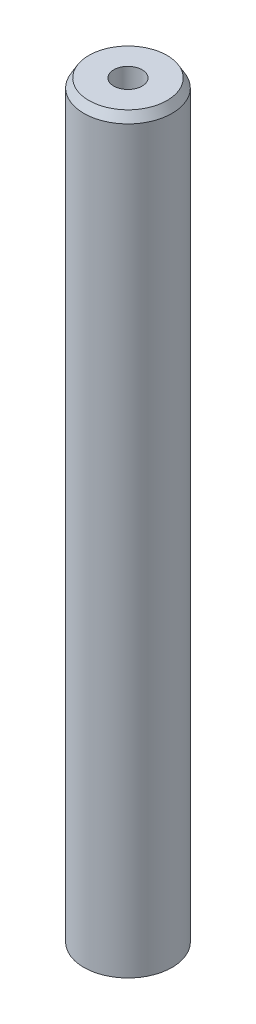
ISO-10303-21;
HEADER;
FILE_DESCRIPTION(('STEP AP214'),'2;1');
FILE_NAME('part.step','',(''),(''),'','','');
FILE_SCHEMA(('AUTOMOTIVE_DESIGN { 1 0 10303 214 1 1 1 1 }'));
ENDSEC;
DATA;
#1=APPLICATION_CONTEXT('core data for automotive mechanical design processes');
#2=APPLICATION_PROTOCOL_DEFINITION('international standard','automotive_design',2000,#1);
#3=PRODUCT_CONTEXT('',#1,'mechanical');
#4=PRODUCT('Part','Part','',(#3));
#5=PRODUCT_RELATED_PRODUCT_CATEGORY('part','',(#4));
#6=PRODUCT_DEFINITION_FORMATION('','',#4);
#7=PRODUCT_DEFINITION_CONTEXT('part definition',#1,'design');
#8=PRODUCT_DEFINITION('design','',#6,#7);
#9=PRODUCT_DEFINITION_SHAPE('','',#8);
#10=(LENGTH_UNIT() NAMED_UNIT(*) SI_UNIT(.MILLI.,.METRE.));
#11=(NAMED_UNIT(*) PLANE_ANGLE_UNIT() SI_UNIT($,.RADIAN.));
#12=(NAMED_UNIT(*) SI_UNIT($,.STERADIAN.) SOLID_ANGLE_UNIT());
#13=UNCERTAINTY_MEASURE_WITH_UNIT(LENGTH_MEASURE(1.E-05),#10,'distance_accuracy_value','');
#14=(GEOMETRIC_REPRESENTATION_CONTEXT(3) GLOBAL_UNCERTAINTY_ASSIGNED_CONTEXT((#13)) GLOBAL_UNIT_ASSIGNED_CONTEXT((#10,
#11,#12)) REPRESENTATION_CONTEXT('',''));
#15=CARTESIAN_POINT('',(0.,0.,0.));
#16=DIRECTION('',(0.,0.,1.));
#17=DIRECTION('',(1.,0.,0.));
#18=AXIS2_PLACEMENT_3D('',#15,#16,#17);
#19=CARTESIAN_POINT('',(0.,85.3970274546246,0.));
#20=DIRECTION('',(0.,-1.,0.));
#21=DIRECTION('',(0.,0.,-1.));
#22=AXIS2_PLACEMENT_3D('',#19,#20,#21);
#23=CYLINDRICAL_SURFACE('',#22,5.);
#24=CARTESIAN_POINT('',(0.,84.4135528989222,0.));
#25=DIRECTION('',(0.,1.,0.));
#26=DIRECTION('',(0.,0.,1.));
#27=AXIS2_PLACEMENT_3D('',#24,#25,#26);
#28=CIRCLE('',#27,5.);
#29=CARTESIAN_POINT('',(0.,84.4135528989222,5.));
#30=VERTEX_POINT('',#29);
#31=EDGE_CURVE('E50',#30,#30,#28,.F.);
#32=ORIENTED_EDGE('',*,*,#31,.T.);
#33=EDGE_LOOP('',(#32));
#34=FACE_BOUND('',#33,.T.);
#35=CARTESIAN_POINT('',(0.,0.567809299475974,0.));
#36=DIRECTION('',(0.,1.,0.));
#37=DIRECTION('',(0.,0.,1.));
#38=AXIS2_PLACEMENT_3D('',#35,#36,#37);
#39=CIRCLE('',#38,5.);
#40=CARTESIAN_POINT('',(0.,0.567809299475974,5.));
#41=VERTEX_POINT('',#40);
#42=EDGE_CURVE('E51',#41,#41,#39,.T.);
#43=ORIENTED_EDGE('',*,*,#42,.T.);
#44=EDGE_LOOP('',(#43));
#45=FACE_BOUND('',#44,.T.);
#46=ADVANCED_FACE('F39',(#34,#45),#23,.T.);
#47=CARTESIAN_POINT('',(0.,85.3970274546246,0.));
#48=DIRECTION('',(0.,1.,0.));
#49=DIRECTION('',(0.,0.,1.));
#50=AXIS2_PLACEMENT_3D('',#47,#48,#49);
#51=PLANE('',#50);
#52=CARTESIAN_POINT('',(0.,85.3970274546246,0.));
#53=DIRECTION('',(0.,1.,0.));
#54=DIRECTION('',(0.,0.,1.));
#55=AXIS2_PLACEMENT_3D('',#52,#53,#54);
#56=CIRCLE('',#55,4.43219070052404);
#57=CARTESIAN_POINT('',(0.,85.3970274546246,4.43219070052404));
#58=VERTEX_POINT('',#57);
#59=EDGE_CURVE('E54',#58,#58,#56,.T.);
#60=ORIENTED_EDGE('',*,*,#59,.T.);
#61=EDGE_LOOP('',(#60));
#62=FACE_BOUND('',#61,.T.);
#63=CARTESIAN_POINT('',(0.,85.3970274546246,0.));
#64=DIRECTION('',(0.,1.,0.));
#65=DIRECTION('',(0.,0.,1.));
#66=AXIS2_PLACEMENT_3D('',#63,#64,#65);
#67=CIRCLE('',#66,1.60883378089151);
#68=CARTESIAN_POINT('',(0.,85.3970274546246,1.60883378089151));
#69=VERTEX_POINT('',#68);
#70=EDGE_CURVE('E58',#69,#69,#67,.T.);
#71=ORIENTED_EDGE('',*,*,#70,.F.);
#72=EDGE_LOOP('',(#71));
#73=FACE_BOUND('',#72,.T.);
#74=ADVANCED_FACE('F69',(#62,#73),#51,.T.);
#75=CARTESIAN_POINT('',(0.,0.,0.));
#76=DIRECTION('',(0.,1.,0.));
#77=DIRECTION('',(0.,0.,1.));
#78=AXIS2_PLACEMENT_3D('',#75,#76,#77);
#79=PLANE('',#78);
#80=CARTESIAN_POINT('',(0.,0.,0.));
#81=DIRECTION('',(0.,1.,0.));
#82=DIRECTION('',(0.,0.,1.));
#83=AXIS2_PLACEMENT_3D('',#80,#81,#82);
#84=CIRCLE('',#83,4.01652544429751);
#85=CARTESIAN_POINT('',(0.,0.,4.01652544429751));
#86=VERTEX_POINT('',#85);
#87=EDGE_CURVE('E10',#86,#86,#84,.F.);
#88=ORIENTED_EDGE('',*,*,#87,.T.);
#89=EDGE_LOOP('',(#88));
#90=FACE_BOUND('',#89,.T.);
#91=CARTESIAN_POINT('',(0.,0.,0.));
#92=DIRECTION('',(0.,1.,0.));
#93=DIRECTION('',(0.,0.,1.));
#94=AXIS2_PLACEMENT_3D('',#91,#92,#93);
#95=CIRCLE('',#94,1.60883378089151);
#96=CARTESIAN_POINT('',(0.,0.,1.60883378089151));
#97=VERTEX_POINT('',#96);
#98=EDGE_CURVE('E63',#97,#97,#95,.T.);
#99=ORIENTED_EDGE('',*,*,#98,.T.);
#100=EDGE_LOOP('',(#99));
#101=FACE_BOUND('',#100,.T.);
#102=ADVANCED_FACE('F75',(#90,#101),#79,.F.);
#103=CARTESIAN_POINT('',(0.,85.3970274546246,0.));
#104=DIRECTION('',(0.,-1.,0.));
#105=DIRECTION('',(0.,0.,-1.));
#106=AXIS2_PLACEMENT_3D('',#103,#104,#105);
#107=CYLINDRICAL_SURFACE('',#106,1.60883378089151);
#108=ORIENTED_EDGE('',*,*,#70,.T.);
#109=EDGE_LOOP('',(#108));
#110=FACE_BOUND('',#109,.T.);
#111=ORIENTED_EDGE('',*,*,#98,.F.);
#112=EDGE_LOOP('',(#111));
#113=FACE_BOUND('',#112,.T.);
#114=ADVANCED_FACE('F70',(#110,#113),#107,.F.);
#115=CARTESIAN_POINT('',(0.,85.3970274546246,0.));
#116=DIRECTION('',(0.,-1.,0.));
#117=DIRECTION('',(0.,0.,-1.));
#118=AXIS2_PLACEMENT_3D('',#115,#116,#117);
#119=CONICAL_SURFACE('',#118,4.43219070052404,0.523598775598295);
#120=ORIENTED_EDGE('',*,*,#31,.F.);
#121=EDGE_LOOP('',(#120));
#122=FACE_BOUND('',#121,.T.);
#123=ORIENTED_EDGE('',*,*,#59,.F.);
#124=EDGE_LOOP('',(#123));
#125=FACE_BOUND('',#124,.T.);
#126=ADVANCED_FACE('F81',(#122,#125),#119,.T.);
#127=CARTESIAN_POINT('',(0.,0.567809299475974,0.));
#128=DIRECTION('',(0.,1.,0.));
#129=DIRECTION('',(0.,0.,1.));
#130=AXIS2_PLACEMENT_3D('',#127,#128,#129);
#131=CONICAL_SURFACE('',#130,5.,1.0471975511966);
#132=ORIENTED_EDGE('',*,*,#87,.F.);
#133=EDGE_LOOP('',(#132));
#134=FACE_BOUND('',#133,.T.);
#135=ORIENTED_EDGE('',*,*,#42,.F.);
#136=EDGE_LOOP('',(#135));
#137=FACE_BOUND('',#136,.T.);
#138=ADVANCED_FACE('F45',(#134,#137),#131,.T.);
#139=CLOSED_SHELL('',(#46,#74,#102,#114,#126,#138));
#140=MANIFOLD_SOLID_BREP('B2',#139);
#141=ADVANCED_BREP_SHAPE_REPRESENTATION('',(#18,#140),#14);
#142=SHAPE_DEFINITION_REPRESENTATION(#9,#141);
ENDSEC;
END-ISO-10303-21;
